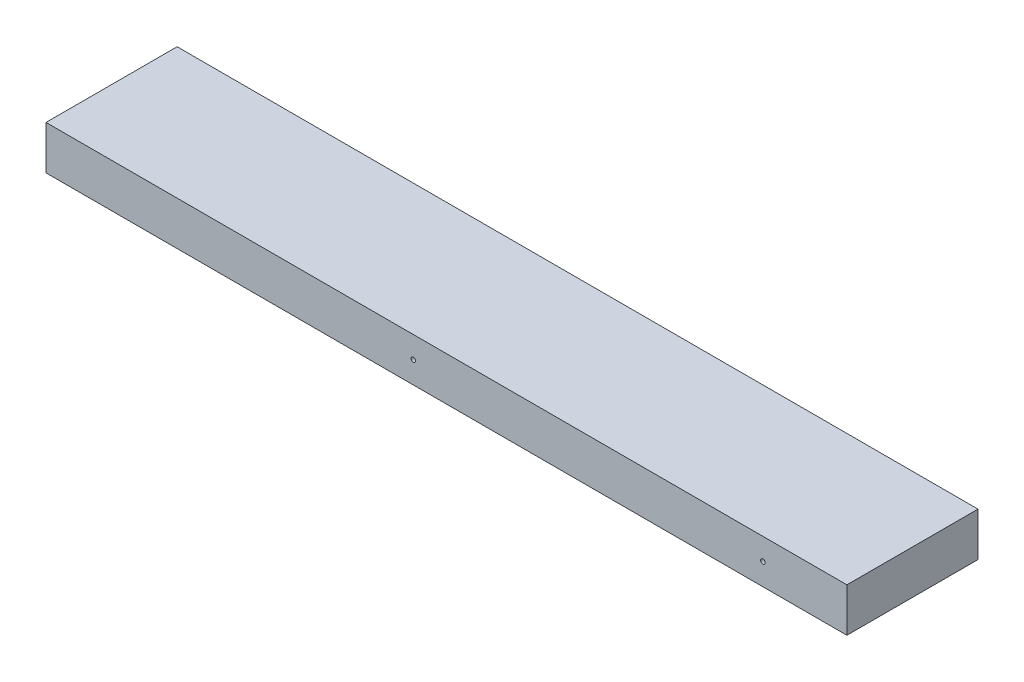
ISO-10303-21;
HEADER;
FILE_DESCRIPTION(('STEP AP214'),'2;1');
FILE_NAME('part.step','',(''),(''),'','','');
FILE_SCHEMA(('AUTOMOTIVE_DESIGN { 1 0 10303 214 1 1 1 1 }'));
ENDSEC;
DATA;
#1=APPLICATION_CONTEXT('core data for automotive mechanical design processes');
#2=APPLICATION_PROTOCOL_DEFINITION('international standard','automotive_design',2000,#1);
#3=PRODUCT_CONTEXT('',#1,'mechanical');
#4=PRODUCT('Part','Part','',(#3));
#5=PRODUCT_RELATED_PRODUCT_CATEGORY('part','',(#4));
#6=PRODUCT_DEFINITION_FORMATION('','',#4);
#7=PRODUCT_DEFINITION_CONTEXT('part definition',#1,'design');
#8=PRODUCT_DEFINITION('design','',#6,#7);
#9=PRODUCT_DEFINITION_SHAPE('','',#8);
#10=(LENGTH_UNIT() NAMED_UNIT(*) SI_UNIT(.MILLI.,.METRE.));
#11=(NAMED_UNIT(*) PLANE_ANGLE_UNIT() SI_UNIT($,.RADIAN.));
#12=(NAMED_UNIT(*) SI_UNIT($,.STERADIAN.) SOLID_ANGLE_UNIT());
#13=UNCERTAINTY_MEASURE_WITH_UNIT(LENGTH_MEASURE(1.E-05),#10,'distance_accuracy_value','');
#14=(GEOMETRIC_REPRESENTATION_CONTEXT(3) GLOBAL_UNCERTAINTY_ASSIGNED_CONTEXT((#13)) GLOBAL_UNIT_ASSIGNED_CONTEXT((#10,
#11,#12)) REPRESENTATION_CONTEXT('',''));
#15=CARTESIAN_POINT('',(0.,0.,0.));
#16=DIRECTION('',(0.,0.,1.));
#17=DIRECTION('',(1.,0.,0.));
#18=AXIS2_PLACEMENT_3D('',#15,#16,#17);
#19=CARTESIAN_POINT('',(-86.3599999999977,5213.35,2683.51));
#20=DIRECTION('',(0.,-1.,0.));
#21=DIRECTION('',(0.,0.,-1.));
#22=AXIS2_PLACEMENT_3D('',#19,#20,#21);
#23=PLANE('',#22);
#24=DIRECTION('',(0.,0.,-1.));
#25=VECTOR('',#24,1.);
#26=CARTESIAN_POINT('',(-96.177951496003,5213.35,2740.66));
#27=LINE('',#26,#25);
#28=CARTESIAN_POINT('',(-96.177951496003,5213.35,2740.66));
#29=VERTEX_POINT('',#28);
#30=CARTESIAN_POINT('',(-96.1779514960027,5213.35,2683.51));
#31=VERTEX_POINT('',#30);
#32=EDGE_CURVE('E101',#29,#31,#27,.T.);
#33=ORIENTED_EDGE('',*,*,#32,.F.);
#34=DIRECTION('',(1.,0.,0.));
#35=VECTOR('',#34,1.);
#36=CARTESIAN_POINT('',(-265.81557086487,5213.35,2740.66));
#37=LINE('',#36,#35);
#38=CARTESIAN_POINT('',(-445.271141729741,5213.35,2740.66));
#39=VERTEX_POINT('',#38);
#40=EDGE_CURVE('E106',#39,#29,#37,.T.);
#41=ORIENTED_EDGE('',*,*,#40,.F.);
#42=DIRECTION('',(0.,0.,-1.));
#43=VECTOR('',#42,1.);
#44=CARTESIAN_POINT('',(-445.27114172974,5213.35,2683.51));
#45=LINE('',#44,#43);
#46=CARTESIAN_POINT('',(-445.27114172974,5213.35,2683.51));
#47=VERTEX_POINT('',#46);
#48=EDGE_CURVE('E144',#39,#47,#45,.T.);
#49=ORIENTED_EDGE('',*,*,#48,.T.);
#50=DIRECTION('',(-1.,0.,0.));
#51=VECTOR('',#50,1.);
#52=CARTESIAN_POINT('',(-265.815570864869,5213.35,2683.51));
#53=LINE('',#52,#51);
#54=EDGE_CURVE('E114',#31,#47,#53,.T.);
#55=ORIENTED_EDGE('',*,*,#54,.F.);
#56=EDGE_LOOP('',(#33,#41,#49,#55));
#57=FACE_BOUND('',#56,.T.);
#58=ADVANCED_FACE('F37',(#57),#23,.T.);
#59=CARTESIAN_POINT('',(-265.81557086487,5222.875,2740.66));
#60=DIRECTION('',(0.,0.,-1.));
#61=DIRECTION('',(1.,0.,0.));
#62=AXIS2_PLACEMENT_3D('',#59,#60,#61);
#63=PLANE('',#62);
#64=CARTESIAN_POINT('',(-132.773222798987,5222.875,2740.66));
#65=DIRECTION('',(0.,0.,1.));
#66=DIRECTION('',(1.,0.,0.));
#67=AXIS2_PLACEMENT_3D('',#64,#65,#66);
#68=CIRCLE('',#67,0.991870000000006);
#69=CARTESIAN_POINT('',(-131.781352798987,5222.875,2740.66));
#70=VERTEX_POINT('',#69);
#71=EDGE_CURVE('E40',#70,#70,#68,.T.);
#72=ORIENTED_EDGE('',*,*,#71,.F.);
#73=EDGE_LOOP('',(#72));
#74=FACE_BOUND('',#73,.T.);
#75=CARTESIAN_POINT('',(-285.173222798987,5222.875,2740.66));
#76=DIRECTION('',(0.,0.,1.));
#77=DIRECTION('',(1.,0.,0.));
#78=AXIS2_PLACEMENT_3D('',#75,#76,#77);
#79=CIRCLE('',#78,0.991870000000006);
#80=CARTESIAN_POINT('',(-284.181352798987,5222.875,2740.66));
#81=VERTEX_POINT('',#80);
#82=EDGE_CURVE('E125',#81,#81,#79,.T.);
#83=ORIENTED_EDGE('',*,*,#82,.F.);
#84=EDGE_LOOP('',(#83));
#85=FACE_BOUND('',#84,.T.);
#86=DIRECTION('',(-1.,0.,0.));
#87=VECTOR('',#86,1.);
#88=CARTESIAN_POINT('',(-445.271141729741,5232.4,2740.66));
#89=LINE('',#88,#87);
#90=CARTESIAN_POINT('',(-96.1779514960036,5232.4,2740.66));
#91=VERTEX_POINT('',#90);
#92=CARTESIAN_POINT('',(-445.271141729741,5232.4,2740.66));
#93=VERTEX_POINT('',#92);
#94=EDGE_CURVE('E138',#91,#93,#89,.T.);
#95=ORIENTED_EDGE('',*,*,#94,.T.);
#96=DIRECTION('',(0.,1.,0.));
#97=VECTOR('',#96,1.);
#98=CARTESIAN_POINT('',(-445.271141729741,5213.35,2740.66));
#99=LINE('',#98,#97);
#100=EDGE_CURVE('E74',#93,#39,#99,.F.);
#101=ORIENTED_EDGE('',*,*,#100,.T.);
#102=ORIENTED_EDGE('',*,*,#40,.T.);
#103=DIRECTION('',(0.,-1.,0.));
#104=VECTOR('',#103,1.);
#105=CARTESIAN_POINT('',(-96.177951496003,5213.35,2740.66));
#106=LINE('',#105,#104);
#107=EDGE_CURVE('E98',#91,#29,#106,.T.);
#108=ORIENTED_EDGE('',*,*,#107,.F.);
#109=EDGE_LOOP('',(#95,#101,#102,#108));
#110=FACE_BOUND('',#109,.T.);
#111=ADVANCED_FACE('F107',(#74,#85,#110),#63,.F.);
#112=CARTESIAN_POINT('',(-445.27114172974,5213.35,2683.51));
#113=DIRECTION('',(-1.,0.,0.));
#114=DIRECTION('',(0.,0.,-1.));
#115=AXIS2_PLACEMENT_3D('',#112,#113,#114);
#116=PLANE('',#115);
#117=DIRECTION('',(0.,1.,0.));
#118=VECTOR('',#117,1.);
#119=CARTESIAN_POINT('',(-445.271141729741,5222.875,2683.51));
#120=LINE('',#119,#118);
#121=CARTESIAN_POINT('',(-445.271141729741,5232.40000000001,2683.51));
#122=VERTEX_POINT('',#121);
#123=EDGE_CURVE('E140',#47,#122,#120,.T.);
#124=ORIENTED_EDGE('',*,*,#123,.F.);
#125=ORIENTED_EDGE('',*,*,#48,.F.);
#126=ORIENTED_EDGE('',*,*,#100,.F.);
#127=DIRECTION('',(0.,0.,1.));
#128=VECTOR('',#127,1.);
#129=CARTESIAN_POINT('',(-445.271141729741,5232.40000000001,2683.51));
#130=LINE('',#129,#128);
#131=EDGE_CURVE('E45',#93,#122,#130,.F.);
#132=ORIENTED_EDGE('',*,*,#131,.T.);
#133=EDGE_LOOP('',(#124,#125,#126,#132));
#134=FACE_BOUND('',#133,.T.);
#135=ADVANCED_FACE('F158',(#134),#116,.T.);
#136=CARTESIAN_POINT('',(-265.815570864869,5222.875,2683.51));
#137=DIRECTION('',(0.,0.,1.));
#138=DIRECTION('',(-1.,0.,0.));
#139=AXIS2_PLACEMENT_3D('',#136,#137,#138);
#140=PLANE('',#139);
#141=CARTESIAN_POINT('',(-412.173222798986,5222.875,2683.51));
#142=DIRECTION('',(0.,0.,-1.));
#143=DIRECTION('',(-1.,0.,0.));
#144=AXIS2_PLACEMENT_3D('',#141,#142,#143);
#145=CIRCLE('',#144,0.991870000000006);
#146=CARTESIAN_POINT('',(-413.165092798986,5222.875,2683.51));
#147=VERTEX_POINT('',#146);
#148=EDGE_CURVE('E129',#147,#147,#145,.T.);
#149=ORIENTED_EDGE('',*,*,#148,.F.);
#150=EDGE_LOOP('',(#149));
#151=FACE_BOUND('',#150,.T.);
#152=CARTESIAN_POINT('',(-310.573222798986,5222.87500000001,2683.51));
#153=DIRECTION('',(0.,0.,-1.));
#154=DIRECTION('',(-1.,0.,0.));
#155=AXIS2_PLACEMENT_3D('',#152,#153,#154);
#156=CIRCLE('',#155,0.991870000000006);
#157=CARTESIAN_POINT('',(-311.565092798986,5222.87500000001,2683.51));
#158=VERTEX_POINT('',#157);
#159=EDGE_CURVE('E133',#158,#158,#156,.T.);
#160=ORIENTED_EDGE('',*,*,#159,.F.);
#161=EDGE_LOOP('',(#160));
#162=FACE_BOUND('',#161,.T.);
#163=CARTESIAN_POINT('',(-107.373222798986,5222.875,2683.51));
#164=DIRECTION('',(0.,0.,-1.));
#165=DIRECTION('',(-1.,0.,0.));
#166=AXIS2_PLACEMENT_3D('',#163,#164,#165);
#167=CIRCLE('',#166,0.991870000000006);
#168=CARTESIAN_POINT('',(-108.365092798986,5222.875,2683.51));
#169=VERTEX_POINT('',#168);
#170=EDGE_CURVE('E110',#169,#169,#167,.T.);
#171=ORIENTED_EDGE('',*,*,#170,.F.);
#172=EDGE_LOOP('',(#171));
#173=FACE_BOUND('',#172,.T.);
#174=ORIENTED_EDGE('',*,*,#54,.T.);
#175=ORIENTED_EDGE('',*,*,#123,.T.);
#176=DIRECTION('',(-1.,0.,0.));
#177=VECTOR('',#176,1.);
#178=CARTESIAN_POINT('',(-445.271141729741,5232.40000000001,2683.51));
#179=LINE('',#178,#177);
#180=CARTESIAN_POINT('',(-96.1779514960034,5232.4,2683.51));
#181=VERTEX_POINT('',#180);
#182=EDGE_CURVE('E11',#122,#181,#179,.F.);
#183=ORIENTED_EDGE('',*,*,#182,.T.);
#184=DIRECTION('',(0.,-1.,0.));
#185=VECTOR('',#184,1.);
#186=CARTESIAN_POINT('',(-96.1779514960027,5213.35,2683.51));
#187=LINE('',#186,#185);
#188=EDGE_CURVE('E103',#181,#31,#187,.T.);
#189=ORIENTED_EDGE('',*,*,#188,.T.);
#190=EDGE_LOOP('',(#174,#175,#183,#189));
#191=FACE_BOUND('',#190,.T.);
#192=ADVANCED_FACE('F164',(#151,#162,#173,#191),#140,.F.);
#193=CARTESIAN_POINT('',(-445.271141729741,5232.40000000001,2683.51));
#194=DIRECTION('',(0.,1.,0.));
#195=DIRECTION('',(0.,0.,1.));
#196=AXIS2_PLACEMENT_3D('',#193,#194,#195);
#197=PLANE('',#196);
#198=DIRECTION('',(0.,0.,-1.));
#199=VECTOR('',#198,1.);
#200=CARTESIAN_POINT('',(-96.1779514960043,5232.4,2740.66));
#201=LINE('',#200,#199);
#202=EDGE_CURVE('E53',#91,#181,#201,.T.);
#203=ORIENTED_EDGE('',*,*,#202,.T.);
#204=ORIENTED_EDGE('',*,*,#182,.F.);
#205=ORIENTED_EDGE('',*,*,#131,.F.);
#206=ORIENTED_EDGE('',*,*,#94,.F.);
#207=EDGE_LOOP('',(#203,#204,#205,#206));
#208=FACE_BOUND('',#207,.T.);
#209=ADVANCED_FACE('F171',(#208),#197,.T.);
#210=CARTESIAN_POINT('',(-107.373222798986,5222.875,2664.46));
#211=DIRECTION('',(0.,0.,-1.));
#212=DIRECTION('',(1.,0.,0.));
#213=AXIS2_PLACEMENT_3D('',#210,#211,#212);
#214=CYLINDRICAL_SURFACE('',#213,0.991870000000006);
#215=CARTESIAN_POINT('',(-107.373222798986,5222.875,2702.56));
#216=DIRECTION('',(0.,0.,1.));
#217=DIRECTION('',(1.,0.,0.));
#218=AXIS2_PLACEMENT_3D('',#215,#216,#217);
#219=CIRCLE('',#218,0.991870000000006);
#220=CARTESIAN_POINT('',(-106.381352798986,5222.875,2702.56));
#221=VERTEX_POINT('',#220);
#222=EDGE_CURVE('E134',#221,#221,#219,.T.);
#223=ORIENTED_EDGE('',*,*,#222,.T.);
#224=EDGE_LOOP('',(#223));
#225=FACE_BOUND('',#224,.T.);
#226=ORIENTED_EDGE('',*,*,#170,.T.);
#227=EDGE_LOOP('',(#226));
#228=FACE_BOUND('',#227,.T.);
#229=ADVANCED_FACE('F175',(#225,#228),#214,.F.);
#230=CARTESIAN_POINT('',(-107.373222798986,5222.875,2702.56));
#231=DIRECTION('',(0.,0.,-1.));
#232=DIRECTION('',(1.,0.,0.));
#233=AXIS2_PLACEMENT_3D('',#230,#231,#232);
#234=CONICAL_SURFACE('',#233,0.991870000000006,1.02974425867677);
#235=CARTESIAN_POINT('',(-107.373222798987,5222.87500000001,2703.1559756222));
#236=VERTEX_POINT('',#235);
#237=VERTEX_LOOP('',#236);
#238=FACE_BOUND('',#237,.T.);
#239=ORIENTED_EDGE('',*,*,#222,.F.);
#240=EDGE_LOOP('',(#239));
#241=FACE_BOUND('',#240,.T.);
#242=ADVANCED_FACE('F176',(#238,#241),#234,.F.);
#243=CARTESIAN_POINT('',(-310.573222798986,5222.87500000001,2664.46));
#244=DIRECTION('',(0.,0.,-1.));
#245=DIRECTION('',(1.,0.,0.));
#246=AXIS2_PLACEMENT_3D('',#243,#244,#245);
#247=CYLINDRICAL_SURFACE('',#246,0.991870000000006);
#248=CARTESIAN_POINT('',(-310.573222798986,5222.875,2702.56));
#249=DIRECTION('',(0.,0.,1.));
#250=DIRECTION('',(1.,0.,0.));
#251=AXIS2_PLACEMENT_3D('',#248,#249,#250);
#252=CIRCLE('',#251,0.991870000000006);
#253=CARTESIAN_POINT('',(-309.581352798986,5222.875,2702.56));
#254=VERTEX_POINT('',#253);
#255=EDGE_CURVE('E130',#254,#254,#252,.T.);
#256=ORIENTED_EDGE('',*,*,#255,.T.);
#257=EDGE_LOOP('',(#256));
#258=FACE_BOUND('',#257,.T.);
#259=ORIENTED_EDGE('',*,*,#159,.T.);
#260=EDGE_LOOP('',(#259));
#261=FACE_BOUND('',#260,.T.);
#262=ADVANCED_FACE('F179',(#258,#261),#247,.F.);
#263=CARTESIAN_POINT('',(-310.573222798986,5222.875,2702.56));
#264=DIRECTION('',(0.,0.,-1.));
#265=DIRECTION('',(1.,0.,0.));
#266=AXIS2_PLACEMENT_3D('',#263,#264,#265);
#267=CONICAL_SURFACE('',#266,0.991870000000006,1.02974425867677);
#268=CARTESIAN_POINT('',(-310.573222798986,5222.875,2703.1559756222));
#269=VERTEX_POINT('',#268);
#270=VERTEX_LOOP('',#269);
#271=FACE_BOUND('',#270,.T.);
#272=ORIENTED_EDGE('',*,*,#255,.F.);
#273=EDGE_LOOP('',(#272));
#274=FACE_BOUND('',#273,.T.);
#275=ADVANCED_FACE('F183',(#271,#274),#267,.F.);
#276=CARTESIAN_POINT('',(-412.173222798986,5222.875,2664.46));
#277=DIRECTION('',(0.,0.,-1.));
#278=DIRECTION('',(1.,0.,0.));
#279=AXIS2_PLACEMENT_3D('',#276,#277,#278);
#280=CYLINDRICAL_SURFACE('',#279,0.991870000000006);
#281=CARTESIAN_POINT('',(-412.173222798987,5222.875,2702.56));
#282=DIRECTION('',(0.,0.,1.));
#283=DIRECTION('',(1.,0.,0.));
#284=AXIS2_PLACEMENT_3D('',#281,#282,#283);
#285=CIRCLE('',#284,0.991870000000006);
#286=CARTESIAN_POINT('',(-411.181352798987,5222.875,2702.56));
#287=VERTEX_POINT('',#286);
#288=EDGE_CURVE('E126',#287,#287,#285,.T.);
#289=ORIENTED_EDGE('',*,*,#288,.T.);
#290=EDGE_LOOP('',(#289));
#291=FACE_BOUND('',#290,.T.);
#292=ORIENTED_EDGE('',*,*,#148,.T.);
#293=EDGE_LOOP('',(#292));
#294=FACE_BOUND('',#293,.T.);
#295=ADVANCED_FACE('F186',(#291,#294),#280,.F.);
#296=CARTESIAN_POINT('',(-412.173222798987,5222.875,2702.56));
#297=DIRECTION('',(0.,0.,-1.));
#298=DIRECTION('',(1.,0.,0.));
#299=AXIS2_PLACEMENT_3D('',#296,#297,#298);
#300=CONICAL_SURFACE('',#299,0.991870000000006,1.02974425867677);
#301=CARTESIAN_POINT('',(-412.173222798987,5222.875,2703.1559756222));
#302=VERTEX_POINT('',#301);
#303=VERTEX_LOOP('',#302);
#304=FACE_BOUND('',#303,.T.);
#305=ORIENTED_EDGE('',*,*,#288,.F.);
#306=EDGE_LOOP('',(#305));
#307=FACE_BOUND('',#306,.T.);
#308=ADVANCED_FACE('F190',(#304,#307),#300,.F.);
#309=CARTESIAN_POINT('',(-285.173222798987,5222.875,2759.71000000001));
#310=DIRECTION('',(0.,0.,1.));
#311=DIRECTION('',(-1.,0.,0.));
#312=AXIS2_PLACEMENT_3D('',#309,#310,#311);
#313=CYLINDRICAL_SURFACE('',#312,0.991870000000006);
#314=CARTESIAN_POINT('',(-285.173222798986,5222.875,2721.61000000001));
#315=DIRECTION('',(0.,0.,-1.));
#316=DIRECTION('',(-1.,0.,0.));
#317=AXIS2_PLACEMENT_3D('',#314,#315,#316);
#318=CIRCLE('',#317,0.991870000000006);
#319=CARTESIAN_POINT('',(-286.165092798986,5222.875,2721.61000000001));
#320=VERTEX_POINT('',#319);
#321=EDGE_CURVE('E122',#320,#320,#318,.T.);
#322=ORIENTED_EDGE('',*,*,#321,.T.);
#323=EDGE_LOOP('',(#322));
#324=FACE_BOUND('',#323,.T.);
#325=ORIENTED_EDGE('',*,*,#82,.T.);
#326=EDGE_LOOP('',(#325));
#327=FACE_BOUND('',#326,.T.);
#328=ADVANCED_FACE('F155',(#324,#327),#313,.F.);
#329=CARTESIAN_POINT('',(-285.173222798986,5222.875,2721.61000000001));
#330=DIRECTION('',(0.,0.,1.));
#331=DIRECTION('',(-1.,0.,0.));
#332=AXIS2_PLACEMENT_3D('',#329,#330,#331);
#333=CONICAL_SURFACE('',#332,0.991870000000006,1.02974425867677);
#334=CARTESIAN_POINT('',(-285.173222798987,5222.875,2721.01402437781));
#335=VERTEX_POINT('',#334);
#336=VERTEX_LOOP('',#335);
#337=FACE_BOUND('',#336,.T.);
#338=ORIENTED_EDGE('',*,*,#321,.F.);
#339=EDGE_LOOP('',(#338));
#340=FACE_BOUND('',#339,.T.);
#341=ADVANCED_FACE('F197',(#337,#340),#333,.F.);
#342=CARTESIAN_POINT('',(-132.773222798987,5222.875,2759.71000000001));
#343=DIRECTION('',(0.,0.,1.));
#344=DIRECTION('',(-1.,0.,0.));
#345=AXIS2_PLACEMENT_3D('',#342,#343,#344);
#346=CYLINDRICAL_SURFACE('',#345,0.991870000000006);
#347=CARTESIAN_POINT('',(-132.773222798987,5222.875,2721.61000000001));
#348=DIRECTION('',(0.,0.,-1.));
#349=DIRECTION('',(-1.,0.,0.));
#350=AXIS2_PLACEMENT_3D('',#347,#348,#349);
#351=CIRCLE('',#350,0.991870000000006);
#352=CARTESIAN_POINT('',(-133.765092798987,5222.875,2721.61000000001));
#353=VERTEX_POINT('',#352);
#354=EDGE_CURVE('E115',#353,#353,#351,.T.);
#355=ORIENTED_EDGE('',*,*,#354,.T.);
#356=EDGE_LOOP('',(#355));
#357=FACE_BOUND('',#356,.T.);
#358=ORIENTED_EDGE('',*,*,#71,.T.);
#359=EDGE_LOOP('',(#358));
#360=FACE_BOUND('',#359,.T.);
#361=ADVANCED_FACE('F200',(#357,#360),#346,.F.);
#362=CARTESIAN_POINT('',(-132.773222798987,5222.875,2721.61000000001));
#363=DIRECTION('',(0.,0.,1.));
#364=DIRECTION('',(-1.,0.,0.));
#365=AXIS2_PLACEMENT_3D('',#362,#363,#364);
#366=CONICAL_SURFACE('',#365,0.991870000000006,1.02974425867677);
#367=CARTESIAN_POINT('',(-132.773222798986,5222.875,2721.01402437781));
#368=VERTEX_POINT('',#367);
#369=VERTEX_LOOP('',#368);
#370=FACE_BOUND('',#369,.T.);
#371=ORIENTED_EDGE('',*,*,#354,.F.);
#372=EDGE_LOOP('',(#371));
#373=FACE_BOUND('',#372,.T.);
#374=ADVANCED_FACE('F205',(#370,#373),#366,.F.);
#375=CARTESIAN_POINT('',(-96.177951496003,5213.35,2740.66));
#376=DIRECTION('',(-1.,0.,0.));
#377=DIRECTION('',(0.,0.,-1.));
#378=AXIS2_PLACEMENT_3D('',#375,#376,#377);
#379=PLANE('',#378);
#380=ORIENTED_EDGE('',*,*,#188,.F.);
#381=ORIENTED_EDGE('',*,*,#202,.F.);
#382=ORIENTED_EDGE('',*,*,#107,.T.);
#383=ORIENTED_EDGE('',*,*,#32,.T.);
#384=EDGE_LOOP('',(#380,#381,#382,#383));
#385=FACE_BOUND('',#384,.T.);
#386=ADVANCED_FACE('F99',(#385),#379,.F.);
#387=CLOSED_SHELL('',(#58,#111,#135,#192,#209,#229,#242,#262,#275,#295,#308,#328,#341,#361,#374,#386));
#388=MANIFOLD_SOLID_BREP('B2',#387);
#389=ADVANCED_BREP_SHAPE_REPRESENTATION('',(#18,#388),#14);
#390=SHAPE_DEFINITION_REPRESENTATION(#9,#389);
ENDSEC;
END-ISO-10303-21;
